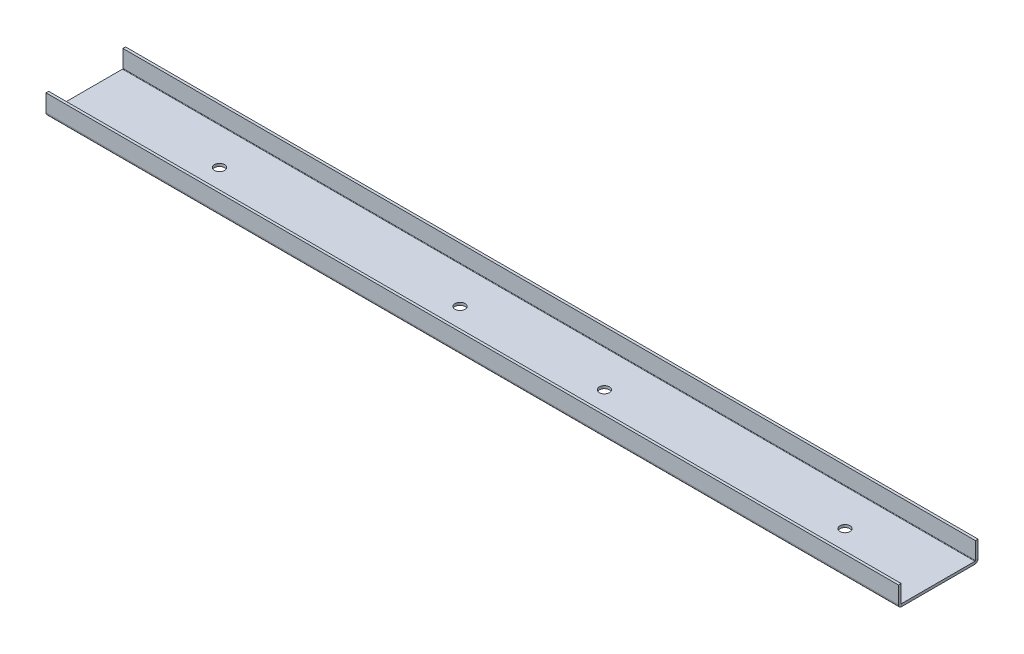
ISO-10303-21;
HEADER;
FILE_DESCRIPTION(('STEP AP214'),'2;1');
FILE_NAME('part.step','',(''),(''),'','','');
FILE_SCHEMA(('AUTOMOTIVE_DESIGN { 1 0 10303 214 1 1 1 1 }'));
ENDSEC;
DATA;
#1=APPLICATION_CONTEXT('core data for automotive mechanical design processes');
#2=APPLICATION_PROTOCOL_DEFINITION('international standard','automotive_design',2000,#1);
#3=PRODUCT_CONTEXT('',#1,'mechanical');
#4=PRODUCT('Part','Part','',(#3));
#5=PRODUCT_RELATED_PRODUCT_CATEGORY('part','',(#4));
#6=PRODUCT_DEFINITION_FORMATION('','',#4);
#7=PRODUCT_DEFINITION_CONTEXT('part definition',#1,'design');
#8=PRODUCT_DEFINITION('design','',#6,#7);
#9=PRODUCT_DEFINITION_SHAPE('','',#8);
#10=(LENGTH_UNIT() NAMED_UNIT(*) SI_UNIT(.MILLI.,.METRE.));
#11=(NAMED_UNIT(*) PLANE_ANGLE_UNIT() SI_UNIT($,.RADIAN.));
#12=(NAMED_UNIT(*) SI_UNIT($,.STERADIAN.) SOLID_ANGLE_UNIT());
#13=UNCERTAINTY_MEASURE_WITH_UNIT(LENGTH_MEASURE(1.E-05),#10,'distance_accuracy_value','');
#14=(GEOMETRIC_REPRESENTATION_CONTEXT(3) GLOBAL_UNCERTAINTY_ASSIGNED_CONTEXT((#13)) GLOBAL_UNIT_ASSIGNED_CONTEXT((#10,
#11,#12)) REPRESENTATION_CONTEXT('',''));
#15=CARTESIAN_POINT('',(0.,0.,0.));
#16=DIRECTION('',(0.,0.,1.));
#17=DIRECTION('',(1.,0.,0.));
#18=AXIS2_PLACEMENT_3D('',#15,#16,#17);
#19=CARTESIAN_POINT('',(450.,0.,-40.35));
#20=DIRECTION('',(1.,0.,0.));
#21=DIRECTION('',(0.,0.,-1.));
#22=AXIS2_PLACEMENT_3D('',#19,#20,#21);
#23=PLANE('',#22);
#24=DIRECTION('',(0.,1.,0.));
#25=VECTOR('',#24,1.);
#26=CARTESIAN_POINT('',(450.,0.,-40.35));
#27=LINE('',#26,#25);
#28=CARTESIAN_POINT('',(450.,0.,-40.35));
#29=VERTEX_POINT('',#28);
#30=CARTESIAN_POINT('',(450.,1.4,-40.35));
#31=VERTEX_POINT('',#30);
#32=EDGE_CURVE('E11',#29,#31,#27,.T.);
#33=ORIENTED_EDGE('',*,*,#32,.F.);
#34=CARTESIAN_POINT('',(450.,1.65,-40.35));
#35=DIRECTION('',(1.,0.,0.));
#36=DIRECTION('',(0.,0.,-1.));
#37=AXIS2_PLACEMENT_3D('',#34,#35,#36);
#38=CIRCLE('',#37,1.65);
#39=CARTESIAN_POINT('',(450.,1.65,-42.));
#40=VERTEX_POINT('',#39);
#41=EDGE_CURVE('E252',#40,#29,#38,.F.);
#42=ORIENTED_EDGE('',*,*,#41,.F.);
#43=DIRECTION('',(0.,0.,-1.));
#44=VECTOR('',#43,1.);
#45=CARTESIAN_POINT('',(450.,1.65,-40.6));
#46=LINE('',#45,#44);
#47=CARTESIAN_POINT('',(450.,1.65,-40.6));
#48=VERTEX_POINT('',#47);
#49=EDGE_CURVE('E49',#48,#40,#46,.T.);
#50=ORIENTED_EDGE('',*,*,#49,.F.);
#51=CARTESIAN_POINT('',(450.,1.65,-40.35));
#52=DIRECTION('',(1.,0.,0.));
#53=DIRECTION('',(0.,0.,-1.));
#54=AXIS2_PLACEMENT_3D('',#51,#52,#53);
#55=CIRCLE('',#54,0.25);
#56=EDGE_CURVE('E150',#48,#31,#55,.F.);
#57=ORIENTED_EDGE('',*,*,#56,.T.);
#58=EDGE_LOOP('',(#33,#42,#50,#57));
#59=FACE_BOUND('',#58,.T.);
#60=ADVANCED_FACE('F41',(#59),#23,.T.);
#61=CARTESIAN_POINT('',(450.,1.65,-40.6));
#62=DIRECTION('',(1.,0.,0.));
#63=DIRECTION('',(0.,0.,-1.));
#64=AXIS2_PLACEMENT_3D('',#61,#62,#63);
#65=PLANE('',#64);
#66=DIRECTION('',(0.,0.,1.));
#67=VECTOR('',#66,1.);
#68=CARTESIAN_POINT('',(450.,0.,0.));
#69=LINE('',#68,#67);
#70=CARTESIAN_POINT('',(450.,0.,-1.65));
#71=VERTEX_POINT('',#70);
#72=EDGE_CURVE('E144',#29,#71,#69,.T.);
#73=ORIENTED_EDGE('',*,*,#72,.F.);
#74=ORIENTED_EDGE('',*,*,#32,.T.);
#75=DIRECTION('',(0.,0.,-1.));
#76=VECTOR('',#75,1.);
#77=CARTESIAN_POINT('',(450.,1.4,0.));
#78=LINE('',#77,#76);
#79=CARTESIAN_POINT('',(450.,1.4,-1.65));
#80=VERTEX_POINT('',#79);
#81=EDGE_CURVE('E141',#31,#80,#78,.F.);
#82=ORIENTED_EDGE('',*,*,#81,.T.);
#83=DIRECTION('',(0.,-1.,0.));
#84=VECTOR('',#83,1.);
#85=CARTESIAN_POINT('',(450.,1.4,-1.65));
#86=LINE('',#85,#84);
#87=EDGE_CURVE('E233',#80,#71,#86,.T.);
#88=ORIENTED_EDGE('',*,*,#87,.T.);
#89=EDGE_LOOP('',(#73,#74,#82,#88));
#90=FACE_BOUND('',#89,.T.);
#91=ADVANCED_FACE('F139',(#90),#65,.T.);
#92=CARTESIAN_POINT('',(0.,1.65,-42.));
#93=DIRECTION('',(-1.,0.,0.));
#94=DIRECTION('',(0.,0.,1.));
#95=AXIS2_PLACEMENT_3D('',#92,#93,#94);
#96=PLANE('',#95);
#97=DIRECTION('',(0.,0.,1.));
#98=VECTOR('',#97,1.);
#99=CARTESIAN_POINT('',(0.,1.65,-42.));
#100=LINE('',#99,#98);
#101=CARTESIAN_POINT('',(0.,1.65,-42.));
#102=VERTEX_POINT('',#101);
#103=CARTESIAN_POINT('',(0.,1.65,-40.6));
#104=VERTEX_POINT('',#103);
#105=EDGE_CURVE('E238',#102,#104,#100,.T.);
#106=ORIENTED_EDGE('',*,*,#105,.F.);
#107=CARTESIAN_POINT('',(0.,1.65,-40.35));
#108=DIRECTION('',(1.,0.,0.));
#109=DIRECTION('',(0.,0.,-1.));
#110=AXIS2_PLACEMENT_3D('',#107,#108,#109);
#111=CIRCLE('',#110,1.65);
#112=CARTESIAN_POINT('',(0.,0.,-40.35));
#113=VERTEX_POINT('',#112);
#114=EDGE_CURVE('E190',#102,#113,#111,.F.);
#115=ORIENTED_EDGE('',*,*,#114,.T.);
#116=DIRECTION('',(0.,-1.,0.));
#117=VECTOR('',#116,1.);
#118=CARTESIAN_POINT('',(0.,1.4,-40.35));
#119=LINE('',#118,#117);
#120=CARTESIAN_POINT('',(0.,1.4,-40.35));
#121=VERTEX_POINT('',#120);
#122=EDGE_CURVE('E236',#121,#113,#119,.T.);
#123=ORIENTED_EDGE('',*,*,#122,.F.);
#124=CARTESIAN_POINT('',(0.,1.65,-40.35));
#125=DIRECTION('',(1.,0.,0.));
#126=DIRECTION('',(0.,0.,-1.));
#127=AXIS2_PLACEMENT_3D('',#124,#125,#126);
#128=CIRCLE('',#127,0.25);
#129=EDGE_CURVE('E162',#104,#121,#128,.F.);
#130=ORIENTED_EDGE('',*,*,#129,.F.);
#131=EDGE_LOOP('',(#106,#115,#123,#130));
#132=FACE_BOUND('',#131,.T.);
#133=ADVANCED_FACE('F323',(#132),#96,.T.);
#134=CARTESIAN_POINT('',(0.,1.4,-40.35));
#135=DIRECTION('',(-1.,0.,0.));
#136=DIRECTION('',(0.,0.,1.));
#137=AXIS2_PLACEMENT_3D('',#134,#135,#136);
#138=PLANE('',#137);
#139=DIRECTION('',(0.,-1.,0.));
#140=VECTOR('',#139,1.);
#141=CARTESIAN_POINT('',(0.,0.,-42.));
#142=LINE('',#141,#140);
#143=CARTESIAN_POINT('',(0.,10.75,-42.));
#144=VERTEX_POINT('',#143);
#145=EDGE_CURVE('E193',#144,#102,#142,.T.);
#146=ORIENTED_EDGE('',*,*,#145,.T.);
#147=ORIENTED_EDGE('',*,*,#105,.T.);
#148=DIRECTION('',(0.,1.,0.));
#149=VECTOR('',#148,1.);
#150=CARTESIAN_POINT('',(0.,0.,-40.6));
#151=LINE('',#150,#149);
#152=CARTESIAN_POINT('',(0.,10.75,-40.6));
#153=VERTEX_POINT('',#152);
#154=EDGE_CURVE('E199',#153,#104,#151,.F.);
#155=ORIENTED_EDGE('',*,*,#154,.F.);
#156=DIRECTION('',(0.,0.,-1.));
#157=VECTOR('',#156,1.);
#158=CARTESIAN_POINT('',(0.,10.75,-40.6));
#159=LINE('',#158,#157);
#160=EDGE_CURVE('E196',#153,#144,#159,.T.);
#161=ORIENTED_EDGE('',*,*,#160,.T.);
#162=EDGE_LOOP('',(#146,#147,#155,#161));
#163=FACE_BOUND('',#162,.T.);
#164=ADVANCED_FACE('F326',(#163),#138,.T.);
#165=CARTESIAN_POINT('',(450.,1.65,0.));
#166=DIRECTION('',(1.,0.,0.));
#167=DIRECTION('',(0.,0.,-1.));
#168=AXIS2_PLACEMENT_3D('',#165,#166,#167);
#169=PLANE('',#168);
#170=DIRECTION('',(0.,0.,-1.));
#171=VECTOR('',#170,1.);
#172=CARTESIAN_POINT('',(450.,1.65,0.));
#173=LINE('',#172,#171);
#174=CARTESIAN_POINT('',(450.,1.65,0.));
#175=VERTEX_POINT('',#174);
#176=CARTESIAN_POINT('',(450.,1.65,-1.4));
#177=VERTEX_POINT('',#176);
#178=EDGE_CURVE('E57',#175,#177,#173,.T.);
#179=ORIENTED_EDGE('',*,*,#178,.F.);
#180=CARTESIAN_POINT('',(450.,1.65,-1.65));
#181=DIRECTION('',(1.,0.,0.));
#182=DIRECTION('',(0.,0.,-1.));
#183=AXIS2_PLACEMENT_3D('',#180,#181,#182);
#184=CIRCLE('',#183,1.65);
#185=EDGE_CURVE('E262',#71,#175,#184,.F.);
#186=ORIENTED_EDGE('',*,*,#185,.F.);
#187=ORIENTED_EDGE('',*,*,#87,.F.);
#188=CARTESIAN_POINT('',(450.,1.65,-1.65));
#189=DIRECTION('',(1.,0.,0.));
#190=DIRECTION('',(0.,0.,-1.));
#191=AXIS2_PLACEMENT_3D('',#188,#189,#190);
#192=CIRCLE('',#191,0.25);
#193=EDGE_CURVE('E170',#80,#177,#192,.F.);
#194=ORIENTED_EDGE('',*,*,#193,.T.);
#195=EDGE_LOOP('',(#179,#186,#187,#194));
#196=FACE_BOUND('',#195,.T.);
#197=ADVANCED_FACE('F351',(#196),#169,.T.);
#198=CARTESIAN_POINT('',(450.,1.4,-1.65));
#199=DIRECTION('',(1.,0.,0.));
#200=DIRECTION('',(0.,0.,-1.));
#201=AXIS2_PLACEMENT_3D('',#198,#199,#200);
#202=PLANE('',#201);
#203=DIRECTION('',(0.,1.,0.));
#204=VECTOR('',#203,1.);
#205=CARTESIAN_POINT('',(450.,0.,0.));
#206=LINE('',#205,#204);
#207=CARTESIAN_POINT('',(450.,10.75,0.));
#208=VERTEX_POINT('',#207);
#209=EDGE_CURVE('E265',#175,#208,#206,.T.);
#210=ORIENTED_EDGE('',*,*,#209,.F.);
#211=ORIENTED_EDGE('',*,*,#178,.T.);
#212=DIRECTION('',(0.,1.,0.));
#213=VECTOR('',#212,1.);
#214=CARTESIAN_POINT('',(450.,0.,-1.4));
#215=LINE('',#214,#213);
#216=CARTESIAN_POINT('',(450.,10.75,-1.4));
#217=VERTEX_POINT('',#216);
#218=EDGE_CURVE('E111',#177,#217,#215,.T.);
#219=ORIENTED_EDGE('',*,*,#218,.T.);
#220=DIRECTION('',(0.,0.,-1.));
#221=VECTOR('',#220,1.);
#222=CARTESIAN_POINT('',(450.,10.75,0.));
#223=LINE('',#222,#221);
#224=EDGE_CURVE('E268',#208,#217,#223,.T.);
#225=ORIENTED_EDGE('',*,*,#224,.F.);
#226=EDGE_LOOP('',(#210,#211,#219,#225));
#227=FACE_BOUND('',#226,.T.);
#228=ADVANCED_FACE('F354',(#227),#202,.T.);
#229=CARTESIAN_POINT('',(0.,0.,-1.65));
#230=DIRECTION('',(-1.,0.,0.));
#231=DIRECTION('',(0.,0.,1.));
#232=AXIS2_PLACEMENT_3D('',#229,#230,#231);
#233=PLANE('',#232);
#234=DIRECTION('',(0.,1.,0.));
#235=VECTOR('',#234,1.);
#236=CARTESIAN_POINT('',(0.,0.,-1.65));
#237=LINE('',#236,#235);
#238=CARTESIAN_POINT('',(0.,0.,-1.65));
#239=VERTEX_POINT('',#238);
#240=CARTESIAN_POINT('',(0.,1.4,-1.65));
#241=VERTEX_POINT('',#240);
#242=EDGE_CURVE('E98',#239,#241,#237,.T.);
#243=ORIENTED_EDGE('',*,*,#242,.F.);
#244=CARTESIAN_POINT('',(0.,1.65,-1.65));
#245=DIRECTION('',(1.,0.,0.));
#246=DIRECTION('',(0.,0.,-1.));
#247=AXIS2_PLACEMENT_3D('',#244,#245,#246);
#248=CIRCLE('',#247,1.65);
#249=CARTESIAN_POINT('',(0.,1.65,0.));
#250=VERTEX_POINT('',#249);
#251=EDGE_CURVE('E186',#239,#250,#248,.F.);
#252=ORIENTED_EDGE('',*,*,#251,.T.);
#253=DIRECTION('',(0.,0.,1.));
#254=VECTOR('',#253,1.);
#255=CARTESIAN_POINT('',(0.,1.65,-1.4));
#256=LINE('',#255,#254);
#257=CARTESIAN_POINT('',(0.,1.65,-1.4));
#258=VERTEX_POINT('',#257);
#259=EDGE_CURVE('E105',#258,#250,#256,.T.);
#260=ORIENTED_EDGE('',*,*,#259,.F.);
#261=CARTESIAN_POINT('',(0.,1.65,-1.65));
#262=DIRECTION('',(1.,0.,0.));
#263=DIRECTION('',(0.,0.,-1.));
#264=AXIS2_PLACEMENT_3D('',#261,#262,#263);
#265=CIRCLE('',#264,0.25);
#266=EDGE_CURVE('E205',#241,#258,#265,.F.);
#267=ORIENTED_EDGE('',*,*,#266,.F.);
#268=EDGE_LOOP('',(#243,#252,#260,#267));
#269=FACE_BOUND('',#268,.T.);
#270=ADVANCED_FACE('F358',(#269),#233,.T.);
#271=CARTESIAN_POINT('',(0.,1.65,-1.4));
#272=DIRECTION('',(-1.,0.,0.));
#273=DIRECTION('',(0.,0.,1.));
#274=AXIS2_PLACEMENT_3D('',#271,#272,#273);
#275=PLANE('',#274);
#276=DIRECTION('',(0.,0.,1.));
#277=VECTOR('',#276,1.);
#278=CARTESIAN_POINT('',(0.,0.,0.));
#279=LINE('',#278,#277);
#280=EDGE_CURVE('E188',#113,#239,#279,.T.);
#281=ORIENTED_EDGE('',*,*,#280,.T.);
#282=ORIENTED_EDGE('',*,*,#242,.T.);
#283=DIRECTION('',(0.,0.,-1.));
#284=VECTOR('',#283,1.);
#285=CARTESIAN_POINT('',(0.,1.4,0.));
#286=LINE('',#285,#284);
#287=EDGE_CURVE('E203',#121,#241,#286,.F.);
#288=ORIENTED_EDGE('',*,*,#287,.F.);
#289=ORIENTED_EDGE('',*,*,#122,.T.);
#290=EDGE_LOOP('',(#281,#282,#288,#289));
#291=FACE_BOUND('',#290,.T.);
#292=ADVANCED_FACE('F361',(#291),#275,.T.);
#293=CARTESIAN_POINT('',(450.,0.,-1.4));
#294=DIRECTION('',(0.,0.,1.));
#295=DIRECTION('',(1.,0.,0.));
#296=AXIS2_PLACEMENT_3D('',#293,#294,#295);
#297=PLANE('',#296);
#298=DIRECTION('',(0.,1.,0.));
#299=VECTOR('',#298,1.);
#300=CARTESIAN_POINT('',(0.,0.,-1.4));
#301=LINE('',#300,#299);
#302=CARTESIAN_POINT('',(0.,10.75,-1.4));
#303=VERTEX_POINT('',#302);
#304=EDGE_CURVE('E176',#258,#303,#301,.T.);
#305=ORIENTED_EDGE('',*,*,#304,.T.);
#306=DIRECTION('',(-1.,0.,0.));
#307=VECTOR('',#306,1.);
#308=CARTESIAN_POINT('',(450.,10.75,-1.4));
#309=LINE('',#308,#307);
#310=EDGE_CURVE('E229',#217,#303,#309,.T.);
#311=ORIENTED_EDGE('',*,*,#310,.F.);
#312=ORIENTED_EDGE('',*,*,#218,.F.);
#313=DIRECTION('',(-1.,0.,0.));
#314=VECTOR('',#313,1.);
#315=CARTESIAN_POINT('',(450.,1.65,-1.4));
#316=LINE('',#315,#314);
#317=EDGE_CURVE('E172',#177,#258,#316,.T.);
#318=ORIENTED_EDGE('',*,*,#317,.T.);
#319=EDGE_LOOP('',(#305,#311,#312,#318));
#320=FACE_BOUND('',#319,.T.);
#321=ADVANCED_FACE('F364',(#320),#297,.F.);
#322=CARTESIAN_POINT('',(450.,10.75,0.));
#323=DIRECTION('',(0.,1.,0.));
#324=DIRECTION('',(0.,0.,1.));
#325=AXIS2_PLACEMENT_3D('',#322,#323,#324);
#326=PLANE('',#325);
#327=DIRECTION('',(0.,0.,-1.));
#328=VECTOR('',#327,1.);
#329=CARTESIAN_POINT('',(0.,10.75,0.));
#330=LINE('',#329,#328);
#331=CARTESIAN_POINT('',(0.,10.75,0.));
#332=VERTEX_POINT('',#331);
#333=EDGE_CURVE('E179',#332,#303,#330,.T.);
#334=ORIENTED_EDGE('',*,*,#333,.F.);
#335=DIRECTION('',(-1.,0.,0.));
#336=VECTOR('',#335,1.);
#337=CARTESIAN_POINT('',(450.,10.75,0.));
#338=LINE('',#337,#336);
#339=EDGE_CURVE('E227',#208,#332,#338,.T.);
#340=ORIENTED_EDGE('',*,*,#339,.F.);
#341=ORIENTED_EDGE('',*,*,#224,.T.);
#342=ORIENTED_EDGE('',*,*,#310,.T.);
#343=EDGE_LOOP('',(#334,#340,#341,#342));
#344=FACE_BOUND('',#343,.T.);
#345=ADVANCED_FACE('F367',(#344),#326,.T.);
#346=CARTESIAN_POINT('',(450.,0.,0.));
#347=DIRECTION('',(0.,0.,1.));
#348=DIRECTION('',(1.,0.,0.));
#349=AXIS2_PLACEMENT_3D('',#346,#347,#348);
#350=PLANE('',#349);
#351=DIRECTION('',(0.,1.,0.));
#352=VECTOR('',#351,1.);
#353=CARTESIAN_POINT('',(0.,0.,0.));
#354=LINE('',#353,#352);
#355=EDGE_CURVE('E183',#250,#332,#354,.T.);
#356=ORIENTED_EDGE('',*,*,#355,.F.);
#357=DIRECTION('',(-1.,0.,0.));
#358=VECTOR('',#357,1.);
#359=CARTESIAN_POINT('',(450.,1.65,0.));
#360=LINE('',#359,#358);
#361=EDGE_CURVE('E224',#175,#250,#360,.T.);
#362=ORIENTED_EDGE('',*,*,#361,.F.);
#363=ORIENTED_EDGE('',*,*,#209,.T.);
#364=ORIENTED_EDGE('',*,*,#339,.T.);
#365=EDGE_LOOP('',(#356,#362,#363,#364));
#366=FACE_BOUND('',#365,.T.);
#367=ADVANCED_FACE('F371',(#366),#350,.T.);
#368=CARTESIAN_POINT('',(450.,1.65,-1.65));
#369=DIRECTION('',(-1.,0.,0.));
#370=DIRECTION('',(0.,0.,1.));
#371=AXIS2_PLACEMENT_3D('',#368,#369,#370);
#372=CYLINDRICAL_SURFACE('',#371,1.65);
#373=ORIENTED_EDGE('',*,*,#251,.F.);
#374=DIRECTION('',(-1.,0.,0.));
#375=VECTOR('',#374,1.);
#376=CARTESIAN_POINT('',(450.,0.,-1.65));
#377=LINE('',#376,#375);
#378=EDGE_CURVE('E221',#71,#239,#377,.T.);
#379=ORIENTED_EDGE('',*,*,#378,.F.);
#380=ORIENTED_EDGE('',*,*,#185,.T.);
#381=ORIENTED_EDGE('',*,*,#361,.T.);
#382=EDGE_LOOP('',(#373,#379,#380,#381));
#383=FACE_BOUND('',#382,.T.);
#384=ADVANCED_FACE('F316',(#383),#372,.T.);
#385=CARTESIAN_POINT('',(450.,0.,0.));
#386=DIRECTION('',(0.,-1.,0.));
#387=DIRECTION('',(0.,0.,-1.));
#388=AXIS2_PLACEMENT_3D('',#385,#386,#387);
#389=PLANE('',#388);
#390=CARTESIAN_POINT('',(400.7875,0.,-21.));
#391=DIRECTION('',(0.,-1.,0.));
#392=DIRECTION('',(0.,0.,-1.));
#393=AXIS2_PLACEMENT_3D('',#390,#391,#392);
#394=CIRCLE('',#393,2.66700000000008);
#395=CARTESIAN_POINT('',(400.7875,0.,-23.6670000000001));
#396=VERTEX_POINT('',#395);
#397=EDGE_CURVE('E278',#396,#396,#394,.T.);
#398=ORIENTED_EDGE('',*,*,#397,.F.);
#399=EDGE_LOOP('',(#398));
#400=FACE_BOUND('',#399,.T.);
#401=CARTESIAN_POINT('',(70.5875000000002,0.,-21.0000000000023));
#402=DIRECTION('',(0.,-1.,0.));
#403=DIRECTION('',(0.,0.,-1.));
#404=AXIS2_PLACEMENT_3D('',#401,#402,#403);
#405=CIRCLE('',#404,2.66700000000008);
#406=CARTESIAN_POINT('',(70.5875000000002,0.,-23.6670000000024));
#407=VERTEX_POINT('',#406);
#408=EDGE_CURVE('E285',#407,#407,#405,.T.);
#409=ORIENTED_EDGE('',*,*,#408,.F.);
#410=EDGE_LOOP('',(#409));
#411=FACE_BOUND('',#410,.T.);
#412=CARTESIAN_POINT('',(197.5875,0.,-21.0000000000014));
#413=DIRECTION('',(0.,-1.,0.));
#414=DIRECTION('',(0.,0.,-1.));
#415=AXIS2_PLACEMENT_3D('',#412,#413,#414);
#416=CIRCLE('',#415,2.66700000000008);
#417=CARTESIAN_POINT('',(197.5875,0.,-23.6670000000015));
#418=VERTEX_POINT('',#417);
#419=EDGE_CURVE('E277',#418,#418,#416,.T.);
#420=ORIENTED_EDGE('',*,*,#419,.F.);
#421=EDGE_LOOP('',(#420));
#422=FACE_BOUND('',#421,.T.);
#423=CARTESIAN_POINT('',(273.7875,0.,-21.0000000000009));
#424=DIRECTION('',(0.,-1.,0.));
#425=DIRECTION('',(0.,0.,-1.));
#426=AXIS2_PLACEMENT_3D('',#423,#424,#425);
#427=CIRCLE('',#426,2.66700000000008);
#428=CARTESIAN_POINT('',(273.7875,0.,-23.667000000001));
#429=VERTEX_POINT('',#428);
#430=EDGE_CURVE('E274',#429,#429,#427,.T.);
#431=ORIENTED_EDGE('',*,*,#430,.F.);
#432=EDGE_LOOP('',(#431));
#433=FACE_BOUND('',#432,.T.);
#434=ORIENTED_EDGE('',*,*,#280,.F.);
#435=DIRECTION('',(-1.,0.,0.));
#436=VECTOR('',#435,1.);
#437=CARTESIAN_POINT('',(450.,0.,-40.35));
#438=LINE('',#437,#436);
#439=EDGE_CURVE('E218',#29,#113,#438,.T.);
#440=ORIENTED_EDGE('',*,*,#439,.F.);
#441=ORIENTED_EDGE('',*,*,#72,.T.);
#442=ORIENTED_EDGE('',*,*,#378,.T.);
#443=EDGE_LOOP('',(#434,#440,#441,#442));
#444=FACE_BOUND('',#443,.T.);
#445=ADVANCED_FACE('F313',(#400,#411,#422,#433,#444),#389,.T.);
#446=CARTESIAN_POINT('',(450.,1.65,-40.35));
#447=DIRECTION('',(-1.,0.,0.));
#448=DIRECTION('',(0.,0.,1.));
#449=AXIS2_PLACEMENT_3D('',#446,#447,#448);
#450=CYLINDRICAL_SURFACE('',#449,1.65);
#451=ORIENTED_EDGE('',*,*,#114,.F.);
#452=DIRECTION('',(-1.,0.,0.));
#453=VECTOR('',#452,1.);
#454=CARTESIAN_POINT('',(450.,1.65,-42.));
#455=LINE('',#454,#453);
#456=EDGE_CURVE('E215',#40,#102,#455,.T.);
#457=ORIENTED_EDGE('',*,*,#456,.F.);
#458=ORIENTED_EDGE('',*,*,#41,.T.);
#459=ORIENTED_EDGE('',*,*,#439,.T.);
#460=EDGE_LOOP('',(#451,#457,#458,#459));
#461=FACE_BOUND('',#460,.T.);
#462=ADVANCED_FACE('F251',(#461),#450,.T.);
#463=CARTESIAN_POINT('',(450.,0.,-42.));
#464=DIRECTION('',(0.,0.,-1.));
#465=DIRECTION('',(-1.,0.,0.));
#466=AXIS2_PLACEMENT_3D('',#463,#464,#465);
#467=PLANE('',#466);
#468=ORIENTED_EDGE('',*,*,#145,.F.);
#469=DIRECTION('',(-1.,0.,0.));
#470=VECTOR('',#469,1.);
#471=CARTESIAN_POINT('',(450.,10.75,-42.));
#472=LINE('',#471,#470);
#473=CARTESIAN_POINT('',(450.,10.75,-42.));
#474=VERTEX_POINT('',#473);
#475=EDGE_CURVE('E213',#474,#144,#472,.T.);
#476=ORIENTED_EDGE('',*,*,#475,.F.);
#477=DIRECTION('',(0.,-1.,0.));
#478=VECTOR('',#477,1.);
#479=CARTESIAN_POINT('',(450.,0.,-42.));
#480=LINE('',#479,#478);
#481=EDGE_CURVE('E245',#474,#40,#480,.T.);
#482=ORIENTED_EDGE('',*,*,#481,.T.);
#483=ORIENTED_EDGE('',*,*,#456,.T.);
#484=EDGE_LOOP('',(#468,#476,#482,#483));
#485=FACE_BOUND('',#484,.T.);
#486=ADVANCED_FACE('F256',(#485),#467,.T.);
#487=CARTESIAN_POINT('',(450.,10.75,-40.6));
#488=DIRECTION('',(0.,1.,0.));
#489=DIRECTION('',(0.,0.,1.));
#490=AXIS2_PLACEMENT_3D('',#487,#488,#489);
#491=PLANE('',#490);
#492=ORIENTED_EDGE('',*,*,#160,.F.);
#493=DIRECTION('',(-1.,0.,0.));
#494=VECTOR('',#493,1.);
#495=CARTESIAN_POINT('',(450.,10.75,-40.6));
#496=LINE('',#495,#494);
#497=CARTESIAN_POINT('',(450.,10.75,-40.6));
#498=VERTEX_POINT('',#497);
#499=EDGE_CURVE('E211',#498,#153,#496,.T.);
#500=ORIENTED_EDGE('',*,*,#499,.F.);
#501=DIRECTION('',(0.,0.,-1.));
#502=VECTOR('',#501,1.);
#503=CARTESIAN_POINT('',(450.,10.75,-40.6));
#504=LINE('',#503,#502);
#505=EDGE_CURVE('E257',#498,#474,#504,.T.);
#506=ORIENTED_EDGE('',*,*,#505,.T.);
#507=ORIENTED_EDGE('',*,*,#475,.T.);
#508=EDGE_LOOP('',(#492,#500,#506,#507));
#509=FACE_BOUND('',#508,.T.);
#510=ADVANCED_FACE('F331',(#509),#491,.T.);
#511=CARTESIAN_POINT('',(450.,0.,-40.6));
#512=DIRECTION('',(0.,0.,-1.));
#513=DIRECTION('',(-1.,0.,0.));
#514=AXIS2_PLACEMENT_3D('',#511,#512,#513);
#515=PLANE('',#514);
#516=ORIENTED_EDGE('',*,*,#154,.T.);
#517=DIRECTION('',(-1.,0.,0.));
#518=VECTOR('',#517,1.);
#519=CARTESIAN_POINT('',(450.,1.65,-40.6));
#520=LINE('',#519,#518);
#521=EDGE_CURVE('E164',#48,#104,#520,.T.);
#522=ORIENTED_EDGE('',*,*,#521,.F.);
#523=DIRECTION('',(0.,1.,0.));
#524=VECTOR('',#523,1.);
#525=CARTESIAN_POINT('',(450.,0.,-40.6));
#526=LINE('',#525,#524);
#527=EDGE_CURVE('E155',#498,#48,#526,.F.);
#528=ORIENTED_EDGE('',*,*,#527,.F.);
#529=ORIENTED_EDGE('',*,*,#499,.T.);
#530=EDGE_LOOP('',(#516,#522,#528,#529));
#531=FACE_BOUND('',#530,.T.);
#532=ADVANCED_FACE('F329',(#531),#515,.F.);
#533=CARTESIAN_POINT('',(450.,1.65,-40.35));
#534=DIRECTION('',(-1.,0.,0.));
#535=DIRECTION('',(0.,0.,1.));
#536=AXIS2_PLACEMENT_3D('',#533,#534,#535);
#537=CYLINDRICAL_SURFACE('',#536,0.25);
#538=ORIENTED_EDGE('',*,*,#129,.T.);
#539=DIRECTION('',(-1.,0.,0.));
#540=VECTOR('',#539,1.);
#541=CARTESIAN_POINT('',(450.,1.4,-40.35));
#542=LINE('',#541,#540);
#543=EDGE_CURVE('E159',#31,#121,#542,.T.);
#544=ORIENTED_EDGE('',*,*,#543,.F.);
#545=ORIENTED_EDGE('',*,*,#56,.F.);
#546=ORIENTED_EDGE('',*,*,#521,.T.);
#547=EDGE_LOOP('',(#538,#544,#545,#546));
#548=FACE_BOUND('',#547,.T.);
#549=ADVANCED_FACE('F160',(#548),#537,.F.);
#550=CARTESIAN_POINT('',(450.,1.4,0.));
#551=DIRECTION('',(0.,-1.,0.));
#552=DIRECTION('',(0.,0.,-1.));
#553=AXIS2_PLACEMENT_3D('',#550,#551,#552);
#554=PLANE('',#553);
#555=CARTESIAN_POINT('',(400.7875,1.4,-21.));
#556=DIRECTION('',(0.,-1.,0.));
#557=DIRECTION('',(0.,0.,-1.));
#558=AXIS2_PLACEMENT_3D('',#555,#556,#557);
#559=CIRCLE('',#558,2.66700000000008);
#560=CARTESIAN_POINT('',(400.7875,1.4,-23.6670000000001));
#561=VERTEX_POINT('',#560);
#562=EDGE_CURVE('E282',#561,#561,#559,.F.);
#563=ORIENTED_EDGE('',*,*,#562,.F.);
#564=EDGE_LOOP('',(#563));
#565=FACE_BOUND('',#564,.T.);
#566=CARTESIAN_POINT('',(70.5875000000002,1.4,-21.0000000000023));
#567=DIRECTION('',(0.,-1.,0.));
#568=DIRECTION('',(0.,0.,-1.));
#569=AXIS2_PLACEMENT_3D('',#566,#567,#568);
#570=CIRCLE('',#569,2.66700000000008);
#571=CARTESIAN_POINT('',(70.5875000000002,1.4,-23.6670000000024));
#572=VERTEX_POINT('',#571);
#573=EDGE_CURVE('E281',#572,#572,#570,.F.);
#574=ORIENTED_EDGE('',*,*,#573,.F.);
#575=EDGE_LOOP('',(#574));
#576=FACE_BOUND('',#575,.T.);
#577=CARTESIAN_POINT('',(197.5875,1.4,-21.0000000000014));
#578=DIRECTION('',(0.,-1.,0.));
#579=DIRECTION('',(0.,0.,-1.));
#580=AXIS2_PLACEMENT_3D('',#577,#578,#579);
#581=CIRCLE('',#580,2.66700000000008);
#582=CARTESIAN_POINT('',(197.5875,1.4,-23.6670000000015));
#583=VERTEX_POINT('',#582);
#584=EDGE_CURVE('E288',#583,#583,#581,.F.);
#585=ORIENTED_EDGE('',*,*,#584,.F.);
#586=EDGE_LOOP('',(#585));
#587=FACE_BOUND('',#586,.T.);
#588=CARTESIAN_POINT('',(273.7875,1.4,-21.0000000000009));
#589=DIRECTION('',(0.,-1.,0.));
#590=DIRECTION('',(0.,0.,-1.));
#591=AXIS2_PLACEMENT_3D('',#588,#589,#590);
#592=CIRCLE('',#591,2.66700000000008);
#593=CARTESIAN_POINT('',(273.7875,1.4,-23.667000000001));
#594=VERTEX_POINT('',#593);
#595=EDGE_CURVE('E180',#594,#594,#592,.F.);
#596=ORIENTED_EDGE('',*,*,#595,.F.);
#597=EDGE_LOOP('',(#596));
#598=FACE_BOUND('',#597,.T.);
#599=ORIENTED_EDGE('',*,*,#287,.T.);
#600=DIRECTION('',(-1.,0.,0.));
#601=VECTOR('',#600,1.);
#602=CARTESIAN_POINT('',(450.,1.4,-1.65));
#603=LINE('',#602,#601);
#604=EDGE_CURVE('E165',#80,#241,#603,.T.);
#605=ORIENTED_EDGE('',*,*,#604,.F.);
#606=ORIENTED_EDGE('',*,*,#81,.F.);
#607=ORIENTED_EDGE('',*,*,#543,.T.);
#608=EDGE_LOOP('',(#599,#605,#606,#607));
#609=FACE_BOUND('',#608,.T.);
#610=ADVANCED_FACE('F167',(#565,#576,#587,#598,#609),#554,.F.);
#611=CARTESIAN_POINT('',(450.,1.65,-1.65));
#612=DIRECTION('',(-1.,0.,0.));
#613=DIRECTION('',(0.,0.,1.));
#614=AXIS2_PLACEMENT_3D('',#611,#612,#613);
#615=CYLINDRICAL_SURFACE('',#614,0.25);
#616=ORIENTED_EDGE('',*,*,#266,.T.);
#617=ORIENTED_EDGE('',*,*,#317,.F.);
#618=ORIENTED_EDGE('',*,*,#193,.F.);
#619=ORIENTED_EDGE('',*,*,#604,.T.);
#620=EDGE_LOOP('',(#616,#617,#618,#619));
#621=FACE_BOUND('',#620,.T.);
#622=ADVANCED_FACE('F301',(#621),#615,.F.);
#623=CARTESIAN_POINT('',(450.,1.65,-1.65));
#624=DIRECTION('',(1.,0.,0.));
#625=DIRECTION('',(0.,0.,-1.));
#626=AXIS2_PLACEMENT_3D('',#623,#624,#625);
#627=PLANE('',#626);
#628=ORIENTED_EDGE('',*,*,#527,.T.);
#629=ORIENTED_EDGE('',*,*,#49,.T.);
#630=ORIENTED_EDGE('',*,*,#481,.F.);
#631=ORIENTED_EDGE('',*,*,#505,.F.);
#632=EDGE_LOOP('',(#628,#629,#630,#631));
#633=FACE_BOUND('',#632,.T.);
#634=ADVANCED_FACE('F242',(#633),#627,.T.);
#635=CARTESIAN_POINT('',(0.,1.65,-1.65));
#636=DIRECTION('',(1.,0.,0.));
#637=DIRECTION('',(0.,0.,-1.));
#638=AXIS2_PLACEMENT_3D('',#635,#636,#637);
#639=PLANE('',#638);
#640=ORIENTED_EDGE('',*,*,#304,.F.);
#641=ORIENTED_EDGE('',*,*,#259,.T.);
#642=ORIENTED_EDGE('',*,*,#355,.T.);
#643=ORIENTED_EDGE('',*,*,#333,.T.);
#644=EDGE_LOOP('',(#640,#641,#642,#643));
#645=FACE_BOUND('',#644,.T.);
#646=ADVANCED_FACE('F309',(#645),#639,.F.);
#647=CARTESIAN_POINT('',(273.7875,8.94341514169833,-21.0000000000009));
#648=DIRECTION('',(0.,-1.,0.));
#649=DIRECTION('',(0.,0.,-1.));
#650=AXIS2_PLACEMENT_3D('',#647,#648,#649);
#651=CYLINDRICAL_SURFACE('',#650,2.66700000000008);
#652=ORIENTED_EDGE('',*,*,#595,.T.);
#653=EDGE_LOOP('',(#652));
#654=FACE_BOUND('',#653,.T.);
#655=ORIENTED_EDGE('',*,*,#430,.T.);
#656=EDGE_LOOP('',(#655));
#657=FACE_BOUND('',#656,.T.);
#658=ADVANCED_FACE('F306',(#654,#657),#651,.F.);
#659=CARTESIAN_POINT('',(197.5875,8.94341514169833,-21.0000000000014));
#660=DIRECTION('',(0.,-1.,0.));
#661=DIRECTION('',(0.,0.,-1.));
#662=AXIS2_PLACEMENT_3D('',#659,#660,#661);
#663=CYLINDRICAL_SURFACE('',#662,2.66700000000008);
#664=ORIENTED_EDGE('',*,*,#584,.T.);
#665=EDGE_LOOP('',(#664));
#666=FACE_BOUND('',#665,.T.);
#667=ORIENTED_EDGE('',*,*,#419,.T.);
#668=EDGE_LOOP('',(#667));
#669=FACE_BOUND('',#668,.T.);
#670=ADVANCED_FACE('F296',(#666,#669),#663,.F.);
#671=CARTESIAN_POINT('',(70.5875000000002,8.94341514169833,-21.0000000000023));
#672=DIRECTION('',(0.,-1.,0.));
#673=DIRECTION('',(0.,0.,-1.));
#674=AXIS2_PLACEMENT_3D('',#671,#672,#673);
#675=CYLINDRICAL_SURFACE('',#674,2.66700000000008);
#676=ORIENTED_EDGE('',*,*,#573,.T.);
#677=EDGE_LOOP('',(#676));
#678=FACE_BOUND('',#677,.T.);
#679=ORIENTED_EDGE('',*,*,#408,.T.);
#680=EDGE_LOOP('',(#679));
#681=FACE_BOUND('',#680,.T.);
#682=ADVANCED_FACE('F469',(#678,#681),#675,.F.);
#683=CARTESIAN_POINT('',(400.7875,8.94341514169833,-21.));
#684=DIRECTION('',(0.,-1.,0.));
#685=DIRECTION('',(0.,0.,-1.));
#686=AXIS2_PLACEMENT_3D('',#683,#684,#685);
#687=CYLINDRICAL_SURFACE('',#686,2.66700000000008);
#688=ORIENTED_EDGE('',*,*,#562,.T.);
#689=EDGE_LOOP('',(#688));
#690=FACE_BOUND('',#689,.T.);
#691=ORIENTED_EDGE('',*,*,#397,.T.);
#692=EDGE_LOOP('',(#691));
#693=FACE_BOUND('',#692,.T.);
#694=ADVANCED_FACE('F479',(#690,#693),#687,.F.);
#695=CLOSED_SHELL('',(#60,#91,#133,#164,#197,#228,#270,#292,#321,#345,#367,#384,#445,#462,#486,
#510,#532,#549,#610,#622,#634,#646,#658,#670,#682,#694));
#696=MANIFOLD_SOLID_BREP('B2',#695);
#697=ADVANCED_BREP_SHAPE_REPRESENTATION('',(#18,#696),#14);
#698=SHAPE_DEFINITION_REPRESENTATION(#9,#697);
ENDSEC;
END-ISO-10303-21;
